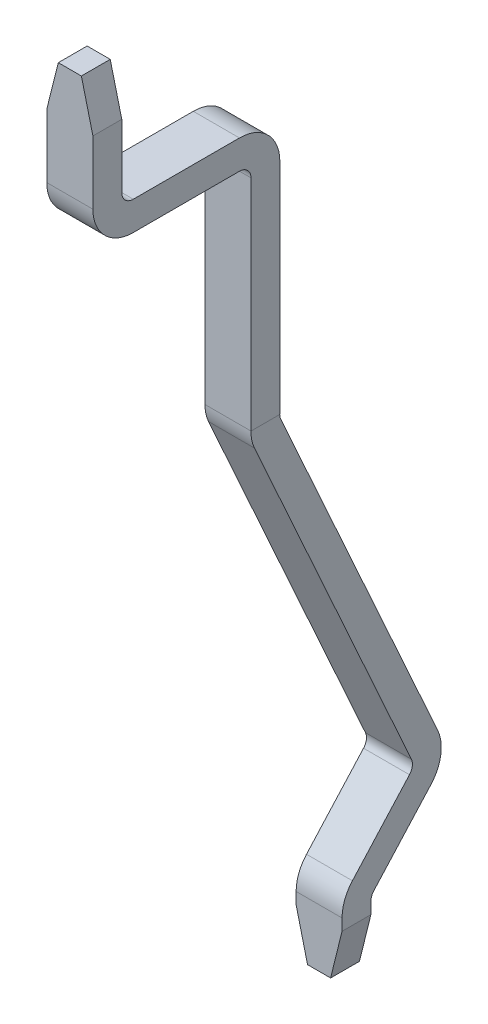
ISO-10303-21;
HEADER;
FILE_DESCRIPTION(('STEP AP214'),'2;1');
FILE_NAME('part.step','',(''),(''),'','','');
FILE_SCHEMA(('AUTOMOTIVE_DESIGN { 1 0 10303 214 1 1 1 1 }'));
ENDSEC;
DATA;
#1=APPLICATION_CONTEXT('core data for automotive mechanical design processes');
#2=APPLICATION_PROTOCOL_DEFINITION('international standard','automotive_design',2000,#1);
#3=PRODUCT_CONTEXT('',#1,'mechanical');
#4=PRODUCT('Part','Part','',(#3));
#5=PRODUCT_RELATED_PRODUCT_CATEGORY('part','',(#4));
#6=PRODUCT_DEFINITION_FORMATION('','',#4);
#7=PRODUCT_DEFINITION_CONTEXT('part definition',#1,'design');
#8=PRODUCT_DEFINITION('design','',#6,#7);
#9=PRODUCT_DEFINITION_SHAPE('','',#8);
#10=(LENGTH_UNIT() NAMED_UNIT(*) SI_UNIT(.MILLI.,.METRE.));
#11=(NAMED_UNIT(*) PLANE_ANGLE_UNIT() SI_UNIT($,.RADIAN.));
#12=(NAMED_UNIT(*) SI_UNIT($,.STERADIAN.) SOLID_ANGLE_UNIT());
#13=UNCERTAINTY_MEASURE_WITH_UNIT(LENGTH_MEASURE(1.E-05),#10,'distance_accuracy_value','');
#14=(GEOMETRIC_REPRESENTATION_CONTEXT(3) GLOBAL_UNCERTAINTY_ASSIGNED_CONTEXT((#13)) GLOBAL_UNIT_ASSIGNED_CONTEXT((#10,
#11,#12)) REPRESENTATION_CONTEXT('',''));
#15=CARTESIAN_POINT('',(0.,0.,0.));
#16=DIRECTION('',(0.,0.,1.));
#17=DIRECTION('',(1.,0.,0.));
#18=AXIS2_PLACEMENT_3D('',#15,#16,#17);
#19=CARTESIAN_POINT('',(-0.8,4.575,1.945));
#20=DIRECTION('',(0.,-1.,0.));
#21=DIRECTION('',(0.,0.,-1.));
#22=AXIS2_PLACEMENT_3D('',#19,#20,#21);
#23=PLANE('',#22);
#24=DIRECTION('',(0.,0.,1.));
#25=VECTOR('',#24,1.);
#26=CARTESIAN_POINT('',(-0.9,4.575,8.99552393868072));
#27=LINE('',#26,#25);
#28=CARTESIAN_POINT('',(-0.9,4.575,1.82));
#29=VERTEX_POINT('',#28);
#30=CARTESIAN_POINT('',(-0.9,4.575,2.07));
#31=VERTEX_POINT('',#30);
#32=EDGE_CURVE('E264',#29,#31,#27,.T.);
#33=ORIENTED_EDGE('',*,*,#32,.T.);
#34=DIRECTION('',(-1.,0.,0.));
#35=VECTOR('',#34,1.);
#36=CARTESIAN_POINT('',(-0.6,4.575,2.07));
#37=LINE('',#36,#35);
#38=CARTESIAN_POINT('',(-0.7,4.575,2.07));
#39=VERTEX_POINT('',#38);
#40=EDGE_CURVE('E235',#31,#39,#37,.F.);
#41=ORIENTED_EDGE('',*,*,#40,.T.);
#42=DIRECTION('',(0.,0.,1.));
#43=VECTOR('',#42,1.);
#44=CARTESIAN_POINT('',(-0.7,4.575,8.99552883706733));
#45=LINE('',#44,#43);
#46=CARTESIAN_POINT('',(-0.7,4.575,1.82));
#47=VERTEX_POINT('',#46);
#48=EDGE_CURVE('E214',#47,#39,#45,.T.);
#49=ORIENTED_EDGE('',*,*,#48,.F.);
#50=DIRECTION('',(1.,0.,0.));
#51=VECTOR('',#50,1.);
#52=CARTESIAN_POINT('',(-1.,4.575,1.82));
#53=LINE('',#52,#51);
#54=EDGE_CURVE('E251',#47,#29,#53,.F.);
#55=ORIENTED_EDGE('',*,*,#54,.T.);
#56=EDGE_LOOP('',(#33,#41,#49,#55));
#57=FACE_BOUND('',#56,.T.);
#58=ADVANCED_FACE('F17',(#57),#23,.F.);
#59=CARTESIAN_POINT('',(-0.9,4.575,8.99552393868072));
#60=DIRECTION('',(0.970142500145331,-0.242535625036336,0.));
#61=DIRECTION('',(0.242535625036336,0.970142500145331,0.));
#62=AXIS2_PLACEMENT_3D('',#59,#60,#61);
#63=PLANE('',#62);
#64=DIRECTION('',(0.242535625036333,0.970142500145332,0.));
#65=VECTOR('',#64,1.);
#66=CARTESIAN_POINT('',(-1.,4.175,2.07));
#67=LINE('',#66,#65);
#68=CARTESIAN_POINT('',(-1.,4.175,2.07));
#69=VERTEX_POINT('',#68);
#70=EDGE_CURVE('E202',#69,#31,#67,.T.);
#71=ORIENTED_EDGE('',*,*,#70,.T.);
#72=ORIENTED_EDGE('',*,*,#32,.F.);
#73=DIRECTION('',(-0.242535625036333,-0.970142500145332,0.));
#74=VECTOR('',#73,1.);
#75=CARTESIAN_POINT('',(-0.9,4.575,1.82));
#76=LINE('',#75,#74);
#77=CARTESIAN_POINT('',(-1.,4.175,1.82));
#78=VERTEX_POINT('',#77);
#79=EDGE_CURVE('E231',#29,#78,#76,.T.);
#80=ORIENTED_EDGE('',*,*,#79,.T.);
#81=DIRECTION('',(0.,0.,1.));
#82=VECTOR('',#81,1.);
#83=CARTESIAN_POINT('',(-1.,4.175,2.07));
#84=LINE('',#83,#82);
#85=EDGE_CURVE('E242',#78,#69,#84,.T.);
#86=ORIENTED_EDGE('',*,*,#85,.T.);
#87=EDGE_LOOP('',(#71,#72,#80,#86));
#88=FACE_BOUND('',#87,.T.);
#89=ADVANCED_FACE('F401',(#88),#63,.F.);
#90=CARTESIAN_POINT('',(-1.,4.575,1.82));
#91=DIRECTION('',(0.,0.,1.));
#92=DIRECTION('',(0.,-1.,0.));
#93=AXIS2_PLACEMENT_3D('',#90,#91,#92);
#94=PLANE('',#93);
#95=ORIENTED_EDGE('',*,*,#79,.F.);
#96=ORIENTED_EDGE('',*,*,#54,.F.);
#97=DIRECTION('',(-0.242535625036336,0.970142500145331,0.));
#98=VECTOR('',#97,1.);
#99=CARTESIAN_POINT('',(-0.7,4.575,1.82));
#100=LINE('',#99,#98);
#101=CARTESIAN_POINT('',(-0.6,4.175,1.82));
#102=VERTEX_POINT('',#101);
#103=EDGE_CURVE('E232',#102,#47,#100,.T.);
#104=ORIENTED_EDGE('',*,*,#103,.F.);
#105=DIRECTION('',(0.,1.,0.));
#106=VECTOR('',#105,1.);
#107=CARTESIAN_POINT('',(-0.6,4.575,1.82));
#108=LINE('',#107,#106);
#109=CARTESIAN_POINT('',(-0.6,3.625,1.82));
#110=VERTEX_POINT('',#109);
#111=EDGE_CURVE('E221',#102,#110,#108,.F.);
#112=ORIENTED_EDGE('',*,*,#111,.T.);
#113=DIRECTION('',(1.,0.,0.));
#114=VECTOR('',#113,1.);
#115=CARTESIAN_POINT('',(-0.8,3.625,1.81999999999999));
#116=LINE('',#115,#114);
#117=CARTESIAN_POINT('',(-1.,3.625,1.82));
#118=VERTEX_POINT('',#117);
#119=EDGE_CURVE('E229',#110,#118,#116,.F.);
#120=ORIENTED_EDGE('',*,*,#119,.T.);
#121=DIRECTION('',(0.,1.,0.));
#122=VECTOR('',#121,1.);
#123=CARTESIAN_POINT('',(-1.,4.575,1.82));
#124=LINE('',#123,#122);
#125=EDGE_CURVE('E246',#118,#78,#124,.T.);
#126=ORIENTED_EDGE('',*,*,#125,.T.);
#127=EDGE_LOOP('',(#95,#96,#104,#112,#120,#126));
#128=FACE_BOUND('',#127,.T.);
#129=ADVANCED_FACE('F396',(#128),#94,.F.);
#130=CARTESIAN_POINT('',(-0.8,3.625,1.72));
#131=DIRECTION('',(1.,0.,0.));
#132=DIRECTION('',(0.,1.,0.));
#133=AXIS2_PLACEMENT_3D('',#130,#131,#132);
#134=CYLINDRICAL_SURFACE('',#133,0.0999999999999946);
#135=ORIENTED_EDGE('',*,*,#119,.F.);
#136=CARTESIAN_POINT('',(-0.6,3.625,1.72));
#137=DIRECTION('',(1.,0.,0.));
#138=DIRECTION('',(0.,1.,0.));
#139=AXIS2_PLACEMENT_3D('',#136,#137,#138);
#140=CIRCLE('',#139,0.0999999999999946);
#141=CARTESIAN_POINT('',(-0.6,3.525,1.72));
#142=VERTEX_POINT('',#141);
#143=EDGE_CURVE('E335',#110,#142,#140,.T.);
#144=ORIENTED_EDGE('',*,*,#143,.T.);
#145=DIRECTION('',(1.,0.,0.));
#146=VECTOR('',#145,1.);
#147=CARTESIAN_POINT('',(-1.,3.525,1.72));
#148=LINE('',#147,#146);
#149=CARTESIAN_POINT('',(-1.,3.525,1.72));
#150=VERTEX_POINT('',#149);
#151=EDGE_CURVE('E227',#142,#150,#148,.F.);
#152=ORIENTED_EDGE('',*,*,#151,.T.);
#153=CARTESIAN_POINT('',(-1.,3.625,1.72));
#154=DIRECTION('',(1.,0.,0.));
#155=DIRECTION('',(0.,1.,0.));
#156=AXIS2_PLACEMENT_3D('',#153,#154,#155);
#157=CIRCLE('',#156,0.0999999999999946);
#158=EDGE_CURVE('E340',#150,#118,#157,.F.);
#159=ORIENTED_EDGE('',*,*,#158,.T.);
#160=EDGE_LOOP('',(#135,#144,#152,#159));
#161=FACE_BOUND('',#160,.T.);
#162=ADVANCED_FACE('F393',(#161),#134,.F.);
#163=CARTESIAN_POINT('',(-1.,3.525,1.72));
#164=DIRECTION('',(0.,-1.,0.));
#165=DIRECTION('',(0.,0.,-1.));
#166=AXIS2_PLACEMENT_3D('',#163,#164,#165);
#167=PLANE('',#166);
#168=ORIENTED_EDGE('',*,*,#151,.F.);
#169=DIRECTION('',(0.,0.,1.));
#170=VECTOR('',#169,1.);
#171=CARTESIAN_POINT('',(-0.6,3.525,1.82));
#172=LINE('',#171,#170);
#173=CARTESIAN_POINT('',(-0.600000000000002,3.525,0.800000000000004));
#174=VERTEX_POINT('',#173);
#175=EDGE_CURVE('E334',#142,#174,#172,.F.);
#176=ORIENTED_EDGE('',*,*,#175,.T.);
#177=DIRECTION('',(-1.,0.,0.));
#178=VECTOR('',#177,1.);
#179=CARTESIAN_POINT('',(-0.8,3.525,0.800000000000004));
#180=LINE('',#179,#178);
#181=CARTESIAN_POINT('',(-1.,3.525,0.800000000000004));
#182=VERTEX_POINT('',#181);
#183=EDGE_CURVE('E178',#182,#174,#180,.F.);
#184=ORIENTED_EDGE('',*,*,#183,.F.);
#185=DIRECTION('',(0.,0.,1.));
#186=VECTOR('',#185,1.);
#187=CARTESIAN_POINT('',(-1.,3.525,2.07));
#188=LINE('',#187,#186);
#189=EDGE_CURVE('E343',#182,#150,#188,.T.);
#190=ORIENTED_EDGE('',*,*,#189,.T.);
#191=EDGE_LOOP('',(#168,#176,#184,#190));
#192=FACE_BOUND('',#191,.T.);
#193=ADVANCED_FACE('F384',(#192),#167,.F.);
#194=CARTESIAN_POINT('',(-0.8,3.175,0.800000000000004));
#195=DIRECTION('',(-1.,0.,0.));
#196=DIRECTION('',(0.,-1.,0.));
#197=AXIS2_PLACEMENT_3D('',#194,#195,#196);
#198=CYLINDRICAL_SURFACE('',#197,0.350000000000005);
#199=CARTESIAN_POINT('',(-0.6,3.175,0.800000000000004));
#200=DIRECTION('',(-1.,0.,0.));
#201=DIRECTION('',(0.,-1.,0.));
#202=AXIS2_PLACEMENT_3D('',#199,#200,#201);
#203=CIRCLE('',#202,0.350000000000005);
#204=CARTESIAN_POINT('',(-0.600000000000002,3.175,0.45));
#205=VERTEX_POINT('',#204);
#206=EDGE_CURVE('E330',#174,#205,#203,.T.);
#207=ORIENTED_EDGE('',*,*,#206,.T.);
#208=DIRECTION('',(1.,0.,0.));
#209=VECTOR('',#208,1.);
#210=CARTESIAN_POINT('',(-1.,3.175,0.45));
#211=LINE('',#210,#209);
#212=CARTESIAN_POINT('',(-1.,3.175,0.45));
#213=VERTEX_POINT('',#212);
#214=EDGE_CURVE('E218',#205,#213,#211,.F.);
#215=ORIENTED_EDGE('',*,*,#214,.T.);
#216=CARTESIAN_POINT('',(-1.,3.175,0.800000000000004));
#217=DIRECTION('',(-1.,0.,0.));
#218=DIRECTION('',(0.,-1.,0.));
#219=AXIS2_PLACEMENT_3D('',#216,#217,#218);
#220=CIRCLE('',#219,0.350000000000005);
#221=EDGE_CURVE('E188',#213,#182,#220,.F.);
#222=ORIENTED_EDGE('',*,*,#221,.T.);
#223=ORIENTED_EDGE('',*,*,#183,.T.);
#224=EDGE_LOOP('',(#207,#215,#222,#223));
#225=FACE_BOUND('',#224,.T.);
#226=ADVANCED_FACE('F389',(#225),#198,.T.);
#227=CARTESIAN_POINT('',(-1.,3.175,0.45));
#228=DIRECTION('',(0.,0.,1.));
#229=DIRECTION('',(0.,-1.,0.));
#230=AXIS2_PLACEMENT_3D('',#227,#228,#229);
#231=PLANE('',#230);
#232=ORIENTED_EDGE('',*,*,#214,.F.);
#233=DIRECTION('',(0.,1.,0.));
#234=VECTOR('',#233,1.);
#235=CARTESIAN_POINT('',(-0.600000000000005,4.575,0.449999999999999));
#236=LINE('',#235,#234);
#237=CARTESIAN_POINT('',(-0.600000000000005,1.275,0.449999999999999));
#238=VERTEX_POINT('',#237);
#239=EDGE_CURVE('E333',#205,#238,#236,.F.);
#240=ORIENTED_EDGE('',*,*,#239,.T.);
#241=DIRECTION('',(1.,0.,0.));
#242=VECTOR('',#241,1.);
#243=CARTESIAN_POINT('',(-0.60100000000001,1.275,0.449999999999998));
#244=LINE('',#243,#242);
#245=CARTESIAN_POINT('',(-0.601000000000005,1.275,0.449999999999999));
#246=VERTEX_POINT('',#245);
#247=EDGE_CURVE('E224',#246,#238,#244,.T.);
#248=ORIENTED_EDGE('',*,*,#247,.F.);
#249=DIRECTION('',(1.,0.,0.));
#250=VECTOR('',#249,1.);
#251=CARTESIAN_POINT('',(-1.,1.275,0.45));
#252=LINE('',#251,#250);
#253=CARTESIAN_POINT('',(-0.998999999999995,1.275,0.449999999999999));
#254=VERTEX_POINT('',#253);
#255=EDGE_CURVE('E174',#254,#246,#252,.T.);
#256=ORIENTED_EDGE('',*,*,#255,.F.);
#257=DIRECTION('',(1.,0.,0.));
#258=VECTOR('',#257,1.);
#259=CARTESIAN_POINT('',(-0.998999999999996,1.275,0.45));
#260=LINE('',#259,#258);
#261=CARTESIAN_POINT('',(-1.,1.275,0.45));
#262=VERTEX_POINT('',#261);
#263=EDGE_CURVE('E20',#262,#254,#260,.T.);
#264=ORIENTED_EDGE('',*,*,#263,.F.);
#265=DIRECTION('',(0.,1.,0.));
#266=VECTOR('',#265,1.);
#267=CARTESIAN_POINT('',(-1.,4.575,0.45));
#268=LINE('',#267,#266);
#269=EDGE_CURVE('E172',#262,#213,#268,.T.);
#270=ORIENTED_EDGE('',*,*,#269,.T.);
#271=EDGE_LOOP('',(#232,#240,#248,#256,#264,#270));
#272=FACE_BOUND('',#271,.T.);
#273=ADVANCED_FACE('F171',(#272),#231,.F.);
#274=CARTESIAN_POINT('',(-0.6,3.275,1.72));
#275=DIRECTION('',(0.,1.,0.));
#276=DIRECTION('',(0.,0.,1.));
#277=AXIS2_PLACEMENT_3D('',#274,#275,#276);
#278=PLANE('',#277);
#279=DIRECTION('',(1.,0.,0.));
#280=VECTOR('',#279,1.);
#281=CARTESIAN_POINT('',(-0.8,3.27500000000001,1.72));
#282=LINE('',#281,#280);
#283=CARTESIAN_POINT('',(-1.,3.275,1.72));
#284=VERTEX_POINT('',#283);
#285=CARTESIAN_POINT('',(-0.6,3.275,1.72));
#286=VERTEX_POINT('',#285);
#287=EDGE_CURVE('E203',#284,#286,#282,.T.);
#288=ORIENTED_EDGE('',*,*,#287,.F.);
#289=DIRECTION('',(0.,0.,1.));
#290=VECTOR('',#289,1.);
#291=CARTESIAN_POINT('',(-1.,3.275,2.07));
#292=LINE('',#291,#290);
#293=CARTESIAN_POINT('',(-1.,3.275,0.800000000000004));
#294=VERTEX_POINT('',#293);
#295=EDGE_CURVE('E194',#284,#294,#292,.F.);
#296=ORIENTED_EDGE('',*,*,#295,.T.);
#297=DIRECTION('',(-1.,0.,0.));
#298=VECTOR('',#297,1.);
#299=CARTESIAN_POINT('',(-0.8,3.275,0.800000000000004));
#300=LINE('',#299,#298);
#301=CARTESIAN_POINT('',(-0.6,3.275,0.800000000000004));
#302=VERTEX_POINT('',#301);
#303=EDGE_CURVE('E219',#294,#302,#300,.F.);
#304=ORIENTED_EDGE('',*,*,#303,.T.);
#305=DIRECTION('',(0.,0.,1.));
#306=VECTOR('',#305,1.);
#307=CARTESIAN_POINT('',(-0.6,3.275,1.82));
#308=LINE('',#307,#306);
#309=EDGE_CURVE('E325',#302,#286,#308,.T.);
#310=ORIENTED_EDGE('',*,*,#309,.T.);
#311=EDGE_LOOP('',(#288,#296,#304,#310));
#312=FACE_BOUND('',#311,.T.);
#313=ADVANCED_FACE('F535',(#312),#278,.F.);
#314=CARTESIAN_POINT('',(-0.8,3.625,1.72));
#315=DIRECTION('',(1.,0.,0.));
#316=DIRECTION('',(0.,1.,0.));
#317=AXIS2_PLACEMENT_3D('',#314,#315,#316);
#318=CYLINDRICAL_SURFACE('',#317,0.349999999999995);
#319=CARTESIAN_POINT('',(-1.,3.625,1.72));
#320=DIRECTION('',(1.,0.,0.));
#321=DIRECTION('',(0.,1.,0.));
#322=AXIS2_PLACEMENT_3D('',#319,#320,#321);
#323=CIRCLE('',#322,0.349999999999995);
#324=CARTESIAN_POINT('',(-1.,3.625,2.07));
#325=VERTEX_POINT('',#324);
#326=EDGE_CURVE('E196',#325,#284,#323,.T.);
#327=ORIENTED_EDGE('',*,*,#326,.T.);
#328=ORIENTED_EDGE('',*,*,#287,.T.);
#329=CARTESIAN_POINT('',(-0.6,3.625,1.72));
#330=DIRECTION('',(1.,0.,0.));
#331=DIRECTION('',(0.,1.,0.));
#332=AXIS2_PLACEMENT_3D('',#329,#330,#331);
#333=CIRCLE('',#332,0.349999999999995);
#334=CARTESIAN_POINT('',(-0.6,3.625,2.07));
#335=VERTEX_POINT('',#334);
#336=EDGE_CURVE('E322',#286,#335,#333,.F.);
#337=ORIENTED_EDGE('',*,*,#336,.T.);
#338=DIRECTION('',(-1.,0.,0.));
#339=VECTOR('',#338,1.);
#340=CARTESIAN_POINT('',(-0.6,3.625,2.07));
#341=LINE('',#340,#339);
#342=EDGE_CURVE('E199',#335,#325,#341,.T.);
#343=ORIENTED_EDGE('',*,*,#342,.T.);
#344=EDGE_LOOP('',(#327,#328,#337,#343));
#345=FACE_BOUND('',#344,.T.);
#346=ADVANCED_FACE('F532',(#345),#318,.T.);
#347=CARTESIAN_POINT('',(-0.6,4.575,2.07));
#348=DIRECTION('',(0.,0.,-1.));
#349=DIRECTION('',(-1.,0.,0.));
#350=AXIS2_PLACEMENT_3D('',#347,#348,#349);
#351=PLANE('',#350);
#352=ORIENTED_EDGE('',*,*,#70,.F.);
#353=DIRECTION('',(0.,1.,0.));
#354=VECTOR('',#353,1.);
#355=CARTESIAN_POINT('',(-1.,4.575,2.07));
#356=LINE('',#355,#354);
#357=EDGE_CURVE('E245',#69,#325,#356,.F.);
#358=ORIENTED_EDGE('',*,*,#357,.T.);
#359=ORIENTED_EDGE('',*,*,#342,.F.);
#360=DIRECTION('',(0.,1.,0.));
#361=VECTOR('',#360,1.);
#362=CARTESIAN_POINT('',(-0.599999999999999,4.575,2.07));
#363=LINE('',#362,#361);
#364=CARTESIAN_POINT('',(-0.599999999999999,4.175,2.07));
#365=VERTEX_POINT('',#364);
#366=EDGE_CURVE('E208',#335,#365,#363,.T.);
#367=ORIENTED_EDGE('',*,*,#366,.T.);
#368=DIRECTION('',(-0.242535625036336,0.970142500145331,0.));
#369=VECTOR('',#368,1.);
#370=CARTESIAN_POINT('',(-0.7,4.575,2.07));
#371=LINE('',#370,#369);
#372=EDGE_CURVE('E211',#39,#365,#371,.F.);
#373=ORIENTED_EDGE('',*,*,#372,.F.);
#374=ORIENTED_EDGE('',*,*,#40,.F.);
#375=EDGE_LOOP('',(#352,#358,#359,#367,#373,#374));
#376=FACE_BOUND('',#375,.T.);
#377=ADVANCED_FACE('F528',(#376),#351,.F.);
#378=CARTESIAN_POINT('',(-0.7,4.575,8.99552883706733));
#379=DIRECTION('',(0.970142500145331,0.242535625036336,0.));
#380=DIRECTION('',(-0.242535625036336,0.970142500145331,0.));
#381=AXIS2_PLACEMENT_3D('',#378,#379,#380);
#382=PLANE('',#381);
#383=ORIENTED_EDGE('',*,*,#372,.T.);
#384=DIRECTION('',(0.,0.,1.));
#385=VECTOR('',#384,1.);
#386=CARTESIAN_POINT('',(-0.6,4.175,1.82));
#387=LINE('',#386,#385);
#388=EDGE_CURVE('E204',#365,#102,#387,.F.);
#389=ORIENTED_EDGE('',*,*,#388,.T.);
#390=ORIENTED_EDGE('',*,*,#103,.T.);
#391=ORIENTED_EDGE('',*,*,#48,.T.);
#392=EDGE_LOOP('',(#383,#389,#390,#391));
#393=FACE_BOUND('',#392,.T.);
#394=ADVANCED_FACE('F525',(#393),#382,.T.);
#395=CARTESIAN_POINT('',(-1.,4.575,2.07));
#396=DIRECTION('',(1.,0.,0.));
#397=DIRECTION('',(0.,1.,0.));
#398=AXIS2_PLACEMENT_3D('',#395,#396,#397);
#399=PLANE('',#398);
#400=ORIENTED_EDGE('',*,*,#85,.F.);
#401=ORIENTED_EDGE('',*,*,#125,.F.);
#402=ORIENTED_EDGE('',*,*,#158,.F.);
#403=ORIENTED_EDGE('',*,*,#189,.F.);
#404=ORIENTED_EDGE('',*,*,#221,.F.);
#405=ORIENTED_EDGE('',*,*,#269,.F.);
#406=DIRECTION('',(0.,0.,1.));
#407=VECTOR('',#406,1.);
#408=CARTESIAN_POINT('',(-1.,1.275,2.07));
#409=LINE('',#408,#407);
#410=CARTESIAN_POINT('',(-0.999999999999998,1.275,0.7));
#411=VERTEX_POINT('',#410);
#412=EDGE_CURVE('E184',#411,#262,#409,.F.);
#413=ORIENTED_EDGE('',*,*,#412,.F.);
#414=DIRECTION('',(0.,1.,0.));
#415=VECTOR('',#414,1.);
#416=CARTESIAN_POINT('',(-0.999999999999996,3.175,0.7));
#417=LINE('',#416,#415);
#418=CARTESIAN_POINT('',(-0.999999999999998,3.175,0.7));
#419=VERTEX_POINT('',#418);
#420=EDGE_CURVE('E207',#411,#419,#417,.T.);
#421=ORIENTED_EDGE('',*,*,#420,.T.);
#422=CARTESIAN_POINT('',(-1.,3.175,0.800000000000004));
#423=DIRECTION('',(-1.,0.,0.));
#424=DIRECTION('',(0.,-1.,0.));
#425=AXIS2_PLACEMENT_3D('',#422,#423,#424);
#426=CIRCLE('',#425,0.100000000000005);
#427=EDGE_CURVE('E222',#419,#294,#426,.F.);
#428=ORIENTED_EDGE('',*,*,#427,.T.);
#429=ORIENTED_EDGE('',*,*,#295,.F.);
#430=ORIENTED_EDGE('',*,*,#326,.F.);
#431=ORIENTED_EDGE('',*,*,#357,.F.);
#432=EDGE_LOOP('',(#400,#401,#402,#403,#404,#405,#413,#421,#428,#429,#430,#431));
#433=FACE_BOUND('',#432,.T.);
#434=ADVANCED_FACE('F182',(#433),#399,.F.);
#435=CARTESIAN_POINT('',(-0.8,3.175,0.800000000000004));
#436=DIRECTION('',(-1.,0.,0.));
#437=DIRECTION('',(0.,-1.,0.));
#438=AXIS2_PLACEMENT_3D('',#435,#436,#437);
#439=CYLINDRICAL_SURFACE('',#438,0.100000000000005);
#440=ORIENTED_EDGE('',*,*,#303,.F.);
#441=ORIENTED_EDGE('',*,*,#427,.F.);
#442=DIRECTION('',(-1.,0.,0.));
#443=VECTOR('',#442,1.);
#444=CARTESIAN_POINT('',(-0.6,3.175,0.7));
#445=LINE('',#444,#443);
#446=CARTESIAN_POINT('',(-0.6,3.175,0.7));
#447=VERTEX_POINT('',#446);
#448=EDGE_CURVE('E371',#419,#447,#445,.F.);
#449=ORIENTED_EDGE('',*,*,#448,.T.);
#450=CARTESIAN_POINT('',(-0.6,3.175,0.800000000000004));
#451=DIRECTION('',(-1.,0.,0.));
#452=DIRECTION('',(0.,-1.,0.));
#453=AXIS2_PLACEMENT_3D('',#450,#451,#452);
#454=CIRCLE('',#453,0.100000000000005);
#455=EDGE_CURVE('E326',#447,#302,#454,.F.);
#456=ORIENTED_EDGE('',*,*,#455,.T.);
#457=EDGE_LOOP('',(#440,#441,#449,#456));
#458=FACE_BOUND('',#457,.T.);
#459=ADVANCED_FACE('F519',(#458),#439,.F.);
#460=CARTESIAN_POINT('',(-0.6,4.575,1.82));
#461=DIRECTION('',(-1.,0.,0.));
#462=DIRECTION('',(0.,0.,1.));
#463=AXIS2_PLACEMENT_3D('',#460,#461,#462);
#464=PLANE('',#463);
#465=ORIENTED_EDGE('',*,*,#366,.F.);
#466=ORIENTED_EDGE('',*,*,#336,.F.);
#467=ORIENTED_EDGE('',*,*,#309,.F.);
#468=ORIENTED_EDGE('',*,*,#455,.F.);
#469=DIRECTION('',(0.,1.,0.));
#470=VECTOR('',#469,1.);
#471=CARTESIAN_POINT('',(-0.6,3.175,0.7));
#472=LINE('',#471,#470);
#473=CARTESIAN_POINT('',(-0.600000000000002,1.275,0.7));
#474=VERTEX_POINT('',#473);
#475=EDGE_CURVE('E359',#447,#474,#472,.F.);
#476=ORIENTED_EDGE('',*,*,#475,.T.);
#477=DIRECTION('',(0.,0.,1.));
#478=VECTOR('',#477,1.);
#479=CARTESIAN_POINT('',(-0.6,1.275,1.82));
#480=LINE('',#479,#478);
#481=EDGE_CURVE('E329',#238,#474,#480,.T.);
#482=ORIENTED_EDGE('',*,*,#481,.F.);
#483=ORIENTED_EDGE('',*,*,#239,.F.);
#484=ORIENTED_EDGE('',*,*,#206,.F.);
#485=ORIENTED_EDGE('',*,*,#175,.F.);
#486=ORIENTED_EDGE('',*,*,#143,.F.);
#487=ORIENTED_EDGE('',*,*,#111,.F.);
#488=ORIENTED_EDGE('',*,*,#388,.F.);
#489=EDGE_LOOP('',(#465,#466,#467,#468,#476,#482,#483,#484,#485,#486,#487,#488));
#490=FACE_BOUND('',#489,.T.);
#491=ADVANCED_FACE('F356',(#490),#464,.F.);
#492=CARTESIAN_POINT('',(-0.6,3.175,0.7));
#493=DIRECTION('',(0.,0.,-1.));
#494=DIRECTION('',(-1.,0.,0.));
#495=AXIS2_PLACEMENT_3D('',#492,#493,#494);
#496=PLANE('',#495);
#497=ORIENTED_EDGE('',*,*,#448,.F.);
#498=ORIENTED_EDGE('',*,*,#420,.F.);
#499=DIRECTION('',(-1.,0.,0.));
#500=VECTOR('',#499,1.);
#501=CARTESIAN_POINT('',(-0.6,1.275,0.7));
#502=LINE('',#501,#500);
#503=CARTESIAN_POINT('',(-0.998999999999993,1.275,0.699999999999999));
#504=VERTEX_POINT('',#503);
#505=EDGE_CURVE('E193',#411,#504,#502,.F.);
#506=ORIENTED_EDGE('',*,*,#505,.T.);
#507=DIRECTION('',(1.,0.,0.));
#508=VECTOR('',#507,1.);
#509=CARTESIAN_POINT('',(-0.8,1.275,0.699999999999998));
#510=LINE('',#509,#508);
#511=CARTESIAN_POINT('',(-0.601000000000003,1.275,0.699999999999999));
#512=VERTEX_POINT('',#511);
#513=EDGE_CURVE('E316',#512,#504,#510,.F.);
#514=ORIENTED_EDGE('',*,*,#513,.F.);
#515=DIRECTION('',(-1.,0.,0.));
#516=VECTOR('',#515,1.);
#517=CARTESIAN_POINT('',(-0.6,1.275,0.7));
#518=LINE('',#517,#516);
#519=EDGE_CURVE('E317',#512,#474,#518,.F.);
#520=ORIENTED_EDGE('',*,*,#519,.T.);
#521=ORIENTED_EDGE('',*,*,#475,.F.);
#522=EDGE_LOOP('',(#497,#498,#506,#514,#520,#521));
#523=FACE_BOUND('',#522,.T.);
#524=ADVANCED_FACE('F512',(#523),#496,.F.);
#525=CARTESIAN_POINT('',(-0.800000000000001,-3.275,-0.215));
#526=DIRECTION('',(0.,-1.,0.));
#527=DIRECTION('',(0.,0.,-1.));
#528=AXIS2_PLACEMENT_3D('',#525,#526,#527);
#529=PLANE('',#528);
#530=DIRECTION('',(1.,0.,0.));
#531=VECTOR('',#530,1.);
#532=CARTESIAN_POINT('',(-0.6,-3.275,-0.0900000000000004));
#533=LINE('',#532,#531);
#534=CARTESIAN_POINT('',(-0.7,-3.275,-0.0900000000000002));
#535=VERTEX_POINT('',#534);
#536=CARTESIAN_POINT('',(-0.9,-3.275,-0.0900000000000002));
#537=VERTEX_POINT('',#536);
#538=EDGE_CURVE('E638',#535,#537,#533,.F.);
#539=ORIENTED_EDGE('',*,*,#538,.T.);
#540=DIRECTION('',(0.,0.,1.));
#541=VECTOR('',#540,1.);
#542=CARTESIAN_POINT('',(-0.9,-3.275,-7.84552393868072));
#543=LINE('',#542,#541);
#544=CARTESIAN_POINT('',(-0.9,-3.275,-0.34));
#545=VERTEX_POINT('',#544);
#546=EDGE_CURVE('E320',#537,#545,#543,.F.);
#547=ORIENTED_EDGE('',*,*,#546,.T.);
#548=DIRECTION('',(1.,0.,0.));
#549=VECTOR('',#548,1.);
#550=CARTESIAN_POINT('',(-1.,-3.275,-0.34));
#551=LINE('',#550,#549);
#552=CARTESIAN_POINT('',(-0.7,-3.275,-0.34));
#553=VERTEX_POINT('',#552);
#554=EDGE_CURVE('E595',#545,#553,#551,.T.);
#555=ORIENTED_EDGE('',*,*,#554,.T.);
#556=DIRECTION('',(0.,0.,1.));
#557=VECTOR('',#556,1.);
#558=CARTESIAN_POINT('',(-0.7,-3.275,-7.84552393868072));
#559=LINE('',#558,#557);
#560=EDGE_CURVE('E321',#535,#553,#559,.F.);
#561=ORIENTED_EDGE('',*,*,#560,.F.);
#562=EDGE_LOOP('',(#539,#547,#555,#561));
#563=FACE_BOUND('',#562,.T.);
#564=ADVANCED_FACE('F508',(#563),#529,.T.);
#565=CARTESIAN_POINT('',(-0.7,-3.275,-7.84552393868072));
#566=DIRECTION('',(0.970710817842158,-0.240250927415917,0.));
#567=DIRECTION('',(0.240250927415917,0.970710817842158,0.));
#568=AXIS2_PLACEMENT_3D('',#565,#566,#567);
#569=PLANE('',#568);
#570=DIRECTION('',(-0.240250927415917,-0.970710817842158,0.));
#571=VECTOR('',#570,1.);
#572=CARTESIAN_POINT('',(-0.601000000000007,-2.875,-0.0900000000000001));
#573=LINE('',#572,#571);
#574=CARTESIAN_POINT('',(-0.601000000000007,-2.875,-0.0900000000000001));
#575=VERTEX_POINT('',#574);
#576=EDGE_CURVE('E634',#575,#535,#573,.T.);
#577=ORIENTED_EDGE('',*,*,#576,.T.);
#578=ORIENTED_EDGE('',*,*,#560,.T.);
#579=DIRECTION('',(0.240250927415917,0.970710817842158,0.));
#580=VECTOR('',#579,1.);
#581=CARTESIAN_POINT('',(-0.7,-3.275,-0.34));
#582=LINE('',#581,#580);
#583=CARTESIAN_POINT('',(-0.601000000000007,-2.875,-0.34));
#584=VERTEX_POINT('',#583);
#585=EDGE_CURVE('E591',#553,#584,#582,.T.);
#586=ORIENTED_EDGE('',*,*,#585,.T.);
#587=DIRECTION('',(0.,0.,-1.));
#588=VECTOR('',#587,1.);
#589=CARTESIAN_POINT('',(-0.601000000000004,-2.875,0.7));
#590=LINE('',#589,#588);
#591=EDGE_CURVE('E581',#575,#584,#590,.T.);
#592=ORIENTED_EDGE('',*,*,#591,.F.);
#593=EDGE_LOOP('',(#577,#578,#586,#592));
#594=FACE_BOUND('',#593,.T.);
#595=ADVANCED_FACE('F505',(#594),#569,.T.);
#596=CARTESIAN_POINT('',(-0.60100000000001,1.275,-0.95));
#597=DIRECTION('',(0.,1.,0.));
#598=DIRECTION('',(0.,0.,1.));
#599=AXIS2_PLACEMENT_3D('',#596,#597,#598);
#600=PLANE('',#599);
#601=ORIENTED_EDGE('',*,*,#519,.F.);
#602=DIRECTION('',(0.,0.,-1.));
#603=VECTOR('',#602,1.);
#604=CARTESIAN_POINT('',(-0.601000000000004,1.275,0.7));
#605=LINE('',#604,#603);
#606=EDGE_CURVE('E306',#246,#512,#605,.F.);
#607=ORIENTED_EDGE('',*,*,#606,.F.);
#608=ORIENTED_EDGE('',*,*,#247,.T.);
#609=ORIENTED_EDGE('',*,*,#481,.T.);
#610=EDGE_LOOP('',(#601,#607,#608,#609));
#611=FACE_BOUND('',#610,.T.);
#612=ADVANCED_FACE('F349',(#611),#600,.F.);
#613=CARTESIAN_POINT('',(-0.9,-3.275,-7.84552393868072));
#614=DIRECTION('',(0.970710817842158,0.240250927415917,0.));
#615=DIRECTION('',(-0.240250927415917,0.970710817842158,0.));
#616=AXIS2_PLACEMENT_3D('',#613,#614,#615);
#617=PLANE('',#616);
#618=DIRECTION('',(-0.240250927415917,0.970710817842158,0.));
#619=VECTOR('',#618,1.);
#620=CARTESIAN_POINT('',(-0.9,-3.275,-0.0900000000000004));
#621=LINE('',#620,#619);
#622=CARTESIAN_POINT('',(-0.998999999999993,-2.875,-0.0900000000000001));
#623=VERTEX_POINT('',#622);
#624=EDGE_CURVE('E635',#537,#623,#621,.T.);
#625=ORIENTED_EDGE('',*,*,#624,.T.);
#626=DIRECTION('',(0.,0.,1.));
#627=VECTOR('',#626,1.);
#628=CARTESIAN_POINT('',(-0.998999999999996,-2.875,0.7));
#629=LINE('',#628,#627);
#630=CARTESIAN_POINT('',(-0.998999999999993,-2.875,-0.34));
#631=VERTEX_POINT('',#630);
#632=EDGE_CURVE('E294',#631,#623,#629,.T.);
#633=ORIENTED_EDGE('',*,*,#632,.F.);
#634=DIRECTION('',(0.240250927415917,-0.970710817842158,0.));
#635=VECTOR('',#634,1.);
#636=CARTESIAN_POINT('',(-0.998999999999993,-2.875,-0.34));
#637=LINE('',#636,#635);
#638=EDGE_CURVE('E609',#631,#545,#637,.T.);
#639=ORIENTED_EDGE('',*,*,#638,.T.);
#640=ORIENTED_EDGE('',*,*,#546,.F.);
#641=EDGE_LOOP('',(#625,#633,#639,#640));
#642=FACE_BOUND('',#641,.T.);
#643=ADVANCED_FACE('F498',(#642),#617,.F.);
#644=CARTESIAN_POINT('',(-0.6,-2.775,-0.0900000000000001));
#645=DIRECTION('',(0.,0.,-1.));
#646=DIRECTION('',(0.,1.,0.));
#647=AXIS2_PLACEMENT_3D('',#644,#645,#646);
#648=PLANE('',#647);
#649=DIRECTION('',(0.,1.,0.));
#650=VECTOR('',#649,1.);
#651=CARTESIAN_POINT('',(-0.601000000000007,-3.275,-0.0900000000000001));
#652=LINE('',#651,#650);
#653=CARTESIAN_POINT('',(-0.601000000000007,-2.775,-0.0900000000000025));
#654=VERTEX_POINT('',#653);
#655=EDGE_CURVE('E587',#654,#575,#652,.F.);
#656=ORIENTED_EDGE('',*,*,#655,.F.);
#657=DIRECTION('',(1.,0.,0.));
#658=VECTOR('',#657,1.);
#659=CARTESIAN_POINT('',(-0.8,-2.775,-0.090000000000005));
#660=LINE('',#659,#658);
#661=CARTESIAN_POINT('',(-0.998999999999993,-2.775,-0.0900000000000025));
#662=VERTEX_POINT('',#661);
#663=EDGE_CURVE('E632',#662,#654,#660,.T.);
#664=ORIENTED_EDGE('',*,*,#663,.F.);
#665=DIRECTION('',(0.,1.,0.));
#666=VECTOR('',#665,1.);
#667=CARTESIAN_POINT('',(-0.998999999999993,-3.275,-0.0900000000000001));
#668=LINE('',#667,#666);
#669=EDGE_CURVE('E290',#623,#662,#668,.T.);
#670=ORIENTED_EDGE('',*,*,#669,.F.);
#671=ORIENTED_EDGE('',*,*,#624,.F.);
#672=ORIENTED_EDGE('',*,*,#538,.F.);
#673=ORIENTED_EDGE('',*,*,#576,.F.);
#674=EDGE_LOOP('',(#656,#664,#670,#671,#672,#673));
#675=FACE_BOUND('',#674,.T.);
#676=ADVANCED_FACE('F494',(#675),#648,.F.);
#677=CARTESIAN_POINT('',(-0.8,-2.775,-0.44));
#678=DIRECTION('',(1.,0.,0.));
#679=DIRECTION('',(0.,1.,0.));
#680=AXIS2_PLACEMENT_3D('',#677,#678,#679);
#681=CYLINDRICAL_SURFACE('',#680,0.349999999999995);
#682=CARTESIAN_POINT('',(-0.601000000000007,-2.775,-0.44));
#683=DIRECTION('',(1.,0.,0.));
#684=DIRECTION('',(0.,1.,0.));
#685=AXIS2_PLACEMENT_3D('',#682,#683,#684);
#686=CIRCLE('',#685,0.349999999999995);
#687=CARTESIAN_POINT('',(-0.601000000000007,-2.54075423726739,-0.179944385482999));
#688=VERTEX_POINT('',#687);
#689=EDGE_CURVE('E295',#688,#654,#686,.T.);
#690=ORIENTED_EDGE('',*,*,#689,.F.);
#691=DIRECTION('',(1.,0.,0.));
#692=VECTOR('',#691,1.);
#693=CARTESIAN_POINT('',(-0.6,-2.54075423726739,-0.179944385483));
#694=LINE('',#693,#692);
#695=CARTESIAN_POINT('',(-0.998999999999993,-2.54075423726739,-0.179944385482999));
#696=VERTEX_POINT('',#695);
#697=EDGE_CURVE('E629',#688,#696,#694,.F.);
#698=ORIENTED_EDGE('',*,*,#697,.T.);
#699=CARTESIAN_POINT('',(-0.998999999999993,-2.775,-0.44));
#700=DIRECTION('',(1.,0.,0.));
#701=DIRECTION('',(0.,1.,0.));
#702=AXIS2_PLACEMENT_3D('',#699,#700,#701);
#703=CIRCLE('',#702,0.349999999999995);
#704=EDGE_CURVE('E288',#662,#696,#703,.F.);
#705=ORIENTED_EDGE('',*,*,#704,.F.);
#706=ORIENTED_EDGE('',*,*,#663,.T.);
#707=EDGE_LOOP('',(#690,#698,#705,#706));
#708=FACE_BOUND('',#707,.T.);
#709=ADVANCED_FACE('F490',(#708),#681,.T.);
#710=CARTESIAN_POINT('',(-0.6,-1.99192736078075,-0.67430160414772));
#711=DIRECTION('',(0.,-0.669273607807463,-0.743016041477155));
#712=DIRECTION('',(0.,0.743016041477155,-0.669273607807463));
#713=AXIS2_PLACEMENT_3D('',#710,#711,#712);
#714=PLANE('',#713);
#715=ORIENTED_EDGE('',*,*,#697,.F.);
#716=DIRECTION('',(0.,-0.743016041477151,0.669273607807469));
#717=VECTOR('',#716,1.);
#718=CARTESIAN_POINT('',(-0.601000000000009,-1.99192736078075,-0.67430160414772));
#719=LINE('',#718,#717);
#720=CARTESIAN_POINT('',(-0.601000000000009,-1.99192736078075,-0.67430160414772));
#721=VERTEX_POINT('',#720);
#722=EDGE_CURVE('E298',#721,#688,#719,.T.);
#723=ORIENTED_EDGE('',*,*,#722,.F.);
#724=DIRECTION('',(-1.,0.,0.));
#725=VECTOR('',#724,1.);
#726=CARTESIAN_POINT('',(-0.8,-1.99192736078075,-0.67430160414772));
#727=LINE('',#726,#725);
#728=CARTESIAN_POINT('',(-0.998999999999991,-1.99192736078075,-0.674301604147719));
#729=VERTEX_POINT('',#728);
#730=EDGE_CURVE('E626',#721,#729,#727,.T.);
#731=ORIENTED_EDGE('',*,*,#730,.T.);
#732=DIRECTION('',(0.,0.743016041477151,-0.669273607807469));
#733=VECTOR('',#732,1.);
#734=CARTESIAN_POINT('',(-0.998999999999993,-2.54075423726739,-0.179944385482996));
#735=LINE('',#734,#733);
#736=EDGE_CURVE('E287',#696,#729,#735,.T.);
#737=ORIENTED_EDGE('',*,*,#736,.F.);
#738=EDGE_LOOP('',(#715,#723,#731,#737));
#739=FACE_BOUND('',#738,.T.);
#740=ADVANCED_FACE('F486',(#739),#714,.F.);
#741=CARTESIAN_POINT('',(-0.8,-1.925,-0.6));
#742=DIRECTION('',(-1.,0.,0.));
#743=DIRECTION('',(0.,-1.,0.));
#744=AXIS2_PLACEMENT_3D('',#741,#742,#743);
#745=CYLINDRICAL_SURFACE('',#744,0.100000000000005);
#746=ORIENTED_EDGE('',*,*,#730,.F.);
#747=CARTESIAN_POINT('',(-0.60100000000001,-1.925,-0.6));
#748=DIRECTION('',(-1.,0.,0.));
#749=DIRECTION('',(0.,-1.,0.));
#750=AXIS2_PLACEMENT_3D('',#747,#748,#749);
#751=CIRCLE('',#750,0.100000000000005);
#752=CARTESIAN_POINT('',(-0.60100000000001,-1.88387647540836,-0.69115292494024));
#753=VERTEX_POINT('',#752);
#754=EDGE_CURVE('E299',#753,#721,#751,.T.);
#755=ORIENTED_EDGE('',*,*,#754,.F.);
#756=DIRECTION('',(1.,0.,0.));
#757=VECTOR('',#756,1.);
#758=CARTESIAN_POINT('',(-0.6,-1.88387647540836,-0.691152924940239));
#759=LINE('',#758,#757);
#760=CARTESIAN_POINT('',(-0.998999999999991,-1.88387647540836,-0.691152924940241));
#761=VERTEX_POINT('',#760);
#762=EDGE_CURVE('E623',#753,#761,#759,.F.);
#763=ORIENTED_EDGE('',*,*,#762,.T.);
#764=CARTESIAN_POINT('',(-0.998999999999991,-1.925,-0.6));
#765=DIRECTION('',(-1.,0.,0.));
#766=DIRECTION('',(0.,-1.,0.));
#767=AXIS2_PLACEMENT_3D('',#764,#765,#766);
#768=CIRCLE('',#767,0.100000000000005);
#769=EDGE_CURVE('E285',#729,#761,#768,.F.);
#770=ORIENTED_EDGE('',*,*,#769,.F.);
#771=EDGE_LOOP('',(#746,#755,#763,#770));
#772=FACE_BOUND('',#771,.T.);
#773=ADVANCED_FACE('F482',(#772),#745,.F.);
#774=CARTESIAN_POINT('',(-0.6,1.13106766392928,0.669035237290843));
#775=DIRECTION('',(0.,0.411235245916341,-0.911529249402413));
#776=DIRECTION('',(0.,0.911529249402413,0.411235245916341));
#777=AXIS2_PLACEMENT_3D('',#774,#775,#776);
#778=PLANE('',#777);
#779=ORIENTED_EDGE('',*,*,#762,.F.);
#780=DIRECTION('',(0.,-0.911529249402413,-0.411235245916341));
#781=VECTOR('',#780,1.);
#782=CARTESIAN_POINT('',(-0.601000000000004,1.13106766392928,0.669035237290843));
#783=LINE('',#782,#781);
#784=CARTESIAN_POINT('',(-0.601000000000004,1.13106766392928,0.669035237290843));
#785=VERTEX_POINT('',#784);
#786=EDGE_CURVE('E302',#785,#753,#783,.T.);
#787=ORIENTED_EDGE('',*,*,#786,.F.);
#788=DIRECTION('',(1.,0.,0.));
#789=VECTOR('',#788,1.);
#790=CARTESIAN_POINT('',(-0.8,1.13106766392928,0.669035237290842));
#791=LINE('',#790,#789);
#792=CARTESIAN_POINT('',(-0.998999999999993,1.13106766392928,0.669035237290843));
#793=VERTEX_POINT('',#792);
#794=EDGE_CURVE('E621',#793,#785,#791,.T.);
#795=ORIENTED_EDGE('',*,*,#794,.F.);
#796=DIRECTION('',(0.,0.911529249402413,0.411235245916341));
#797=VECTOR('',#796,1.);
#798=CARTESIAN_POINT('',(-0.998999999999991,-1.88387647540836,-0.69115292494024));
#799=LINE('',#798,#797);
#800=EDGE_CURVE('E284',#761,#793,#799,.T.);
#801=ORIENTED_EDGE('',*,*,#800,.F.);
#802=EDGE_LOOP('',(#779,#787,#795,#801));
#803=FACE_BOUND('',#802,.T.);
#804=ADVANCED_FACE('F478',(#803),#778,.F.);
#805=CARTESIAN_POINT('',(-0.8,1.275,0.350000000000003));
#806=DIRECTION('',(1.,0.,0.));
#807=DIRECTION('',(0.,1.,0.));
#808=AXIS2_PLACEMENT_3D('',#805,#806,#807);
#809=CYLINDRICAL_SURFACE('',#808,0.349999999999995);
#810=CARTESIAN_POINT('',(-0.601000000000004,1.275,0.350000000000003));
#811=DIRECTION('',(1.,0.,0.));
#812=DIRECTION('',(0.,1.,0.));
#813=AXIS2_PLACEMENT_3D('',#810,#811,#812);
#814=CIRCLE('',#813,0.349999999999995);
#815=EDGE_CURVE('E303',#512,#785,#814,.T.);
#816=ORIENTED_EDGE('',*,*,#815,.F.);
#817=ORIENTED_EDGE('',*,*,#513,.T.);
#818=CARTESIAN_POINT('',(-0.99899999999999,1.275,0.350000000000003));
#819=DIRECTION('',(1.,0.,0.));
#820=DIRECTION('',(0.,1.,0.));
#821=AXIS2_PLACEMENT_3D('',#818,#819,#820);
#822=CIRCLE('',#821,0.349999999999995);
#823=EDGE_CURVE('E281',#793,#504,#822,.F.);
#824=ORIENTED_EDGE('',*,*,#823,.F.);
#825=ORIENTED_EDGE('',*,*,#794,.T.);
#826=EDGE_LOOP('',(#816,#817,#824,#825));
#827=FACE_BOUND('',#826,.T.);
#828=ADVANCED_FACE('F475',(#827),#809,.T.);
#829=CARTESIAN_POINT('',(-0.998999999999996,1.275,0.7));
#830=DIRECTION('',(0.,1.,0.));
#831=DIRECTION('',(0.,0.,1.));
#832=AXIS2_PLACEMENT_3D('',#829,#830,#831);
#833=PLANE('',#832);
#834=ORIENTED_EDGE('',*,*,#505,.F.);
#835=ORIENTED_EDGE('',*,*,#412,.T.);
#836=ORIENTED_EDGE('',*,*,#263,.T.);
#837=DIRECTION('',(0.,0.,1.));
#838=VECTOR('',#837,1.);
#839=CARTESIAN_POINT('',(-0.998999999999996,1.275,0.7));
#840=LINE('',#839,#838);
#841=EDGE_CURVE('E280',#504,#254,#840,.F.);
#842=ORIENTED_EDGE('',*,*,#841,.F.);
#843=EDGE_LOOP('',(#834,#835,#836,#842));
#844=FACE_BOUND('',#843,.T.);
#845=ADVANCED_FACE('F191',(#844),#833,.F.);
#846=CARTESIAN_POINT('',(-1.,-2.15924576273261,-0.860055614517));
#847=DIRECTION('',(0.,0.669273607807463,0.743016041477155));
#848=DIRECTION('',(0.,-0.743016041477155,0.669273607807463));
#849=AXIS2_PLACEMENT_3D('',#846,#847,#848);
#850=PLANE('',#849);
#851=DIRECTION('',(-1.,0.,0.));
#852=VECTOR('',#851,1.);
#853=CARTESIAN_POINT('',(-0.8,-2.15924576273262,-0.860055614517007));
#854=LINE('',#853,#852);
#855=CARTESIAN_POINT('',(-0.60100000000001,-2.15924576273261,-0.860055614517005));
#856=VERTEX_POINT('',#855);
#857=CARTESIAN_POINT('',(-0.99899999999999,-2.15924576273261,-0.860055614517005));
#858=VERTEX_POINT('',#857);
#859=EDGE_CURVE('E437',#856,#858,#854,.T.);
#860=ORIENTED_EDGE('',*,*,#859,.F.);
#861=DIRECTION('',(0.,0.743016041477162,-0.669273607807455));
#862=VECTOR('',#861,1.);
#863=CARTESIAN_POINT('',(-0.601000000000008,-2.70807263921926,-0.365698395852285));
#864=LINE('',#863,#862);
#865=CARTESIAN_POINT('',(-0.601000000000008,-2.70807263921926,-0.365698395852286));
#866=VERTEX_POINT('',#865);
#867=EDGE_CURVE('E309',#866,#856,#864,.T.);
#868=ORIENTED_EDGE('',*,*,#867,.F.);
#869=DIRECTION('',(1.,0.,0.));
#870=VECTOR('',#869,1.);
#871=CARTESIAN_POINT('',(-0.8,-2.70807263921926,-0.365698395852285));
#872=LINE('',#871,#870);
#873=CARTESIAN_POINT('',(-0.998999999999992,-2.70807263921926,-0.365698395852286));
#874=VERTEX_POINT('',#873);
#875=EDGE_CURVE('E315',#866,#874,#872,.F.);
#876=ORIENTED_EDGE('',*,*,#875,.T.);
#877=DIRECTION('',(0.,-0.743016041477162,0.669273607807455));
#878=VECTOR('',#877,1.);
#879=CARTESIAN_POINT('',(-0.998999999999991,-2.15924576273261,-0.860055614517));
#880=LINE('',#879,#878);
#881=EDGE_CURVE('E275',#858,#874,#880,.T.);
#882=ORIENTED_EDGE('',*,*,#881,.F.);
#883=EDGE_LOOP('',(#860,#868,#876,#882));
#884=FACE_BOUND('',#883,.T.);
#885=ADVANCED_FACE('F468',(#884),#850,.F.);
#886=CARTESIAN_POINT('',(-0.8,-2.775,-0.44));
#887=DIRECTION('',(1.,0.,0.));
#888=DIRECTION('',(0.,1.,0.));
#889=AXIS2_PLACEMENT_3D('',#886,#887,#888);
#890=CYLINDRICAL_SURFACE('',#889,0.0999999999999952);
#891=ORIENTED_EDGE('',*,*,#875,.F.);
#892=CARTESIAN_POINT('',(-0.601000000000008,-2.775,-0.44));
#893=DIRECTION('',(1.,0.,0.));
#894=DIRECTION('',(0.,1.,0.));
#895=AXIS2_PLACEMENT_3D('',#892,#893,#894);
#896=CIRCLE('',#895,0.0999999999999952);
#897=CARTESIAN_POINT('',(-0.601000000000008,-2.775,-0.34));
#898=VERTEX_POINT('',#897);
#899=EDGE_CURVE('E310',#898,#866,#896,.F.);
#900=ORIENTED_EDGE('',*,*,#899,.F.);
#901=DIRECTION('',(1.,0.,0.));
#902=VECTOR('',#901,1.);
#903=CARTESIAN_POINT('',(-1.,-2.775,-0.34));
#904=LINE('',#903,#902);
#905=CARTESIAN_POINT('',(-0.998999999999992,-2.775,-0.34));
#906=VERTEX_POINT('',#905);
#907=EDGE_CURVE('E598',#898,#906,#904,.F.);
#908=ORIENTED_EDGE('',*,*,#907,.T.);
#909=CARTESIAN_POINT('',(-0.998999999999992,-2.775,-0.44));
#910=DIRECTION('',(1.,0.,0.));
#911=DIRECTION('',(0.,1.,0.));
#912=AXIS2_PLACEMENT_3D('',#909,#910,#911);
#913=CIRCLE('',#912,0.0999999999999952);
#914=EDGE_CURVE('E271',#874,#906,#913,.T.);
#915=ORIENTED_EDGE('',*,*,#914,.F.);
#916=EDGE_LOOP('',(#891,#900,#908,#915));
#917=FACE_BOUND('',#916,.T.);
#918=ADVANCED_FACE('F464',(#917),#890,.F.);
#919=CARTESIAN_POINT('',(-1.,-2.775,-0.34));
#920=DIRECTION('',(0.,0.,1.));
#921=DIRECTION('',(0.,-1.,0.));
#922=AXIS2_PLACEMENT_3D('',#919,#920,#921);
#923=PLANE('',#922);
#924=ORIENTED_EDGE('',*,*,#554,.F.);
#925=ORIENTED_EDGE('',*,*,#638,.F.);
#926=DIRECTION('',(0.,1.,0.));
#927=VECTOR('',#926,1.);
#928=CARTESIAN_POINT('',(-0.998999999999993,-3.275,-0.34));
#929=LINE('',#928,#927);
#930=EDGE_CURVE('E274',#906,#631,#929,.F.);
#931=ORIENTED_EDGE('',*,*,#930,.F.);
#932=ORIENTED_EDGE('',*,*,#907,.F.);
#933=DIRECTION('',(0.,1.,0.));
#934=VECTOR('',#933,1.);
#935=CARTESIAN_POINT('',(-0.601000000000008,-3.275,-0.34));
#936=LINE('',#935,#934);
#937=EDGE_CURVE('E313',#584,#898,#936,.T.);
#938=ORIENTED_EDGE('',*,*,#937,.F.);
#939=ORIENTED_EDGE('',*,*,#585,.F.);
#940=EDGE_LOOP('',(#924,#925,#931,#932,#938,#939));
#941=FACE_BOUND('',#940,.T.);
#942=ADVANCED_FACE('F461',(#941),#923,.F.);
#943=CARTESIAN_POINT('',(-0.8,-1.925,-0.6));
#944=DIRECTION('',(-1.,0.,0.));
#945=DIRECTION('',(0.,-1.,0.));
#946=AXIS2_PLACEMENT_3D('',#943,#944,#945);
#947=CYLINDRICAL_SURFACE('',#946,0.350000000000005);
#948=DIRECTION('',(1.,0.,0.));
#949=VECTOR('',#948,1.);
#950=CARTESIAN_POINT('',(-1.,-1.78106766392928,-0.919035237290846));
#951=LINE('',#950,#949);
#952=CARTESIAN_POINT('',(-0.998999999999993,-1.78106766392928,-0.919035237290846));
#953=VERTEX_POINT('',#952);
#954=CARTESIAN_POINT('',(-0.60100000000001,-1.78106766392928,-0.919035237290846));
#955=VERTEX_POINT('',#954);
#956=EDGE_CURVE('E424',#953,#955,#951,.T.);
#957=ORIENTED_EDGE('',*,*,#956,.T.);
#958=CARTESIAN_POINT('',(-0.60100000000001,-1.925,-0.6));
#959=DIRECTION('',(-1.,0.,0.));
#960=DIRECTION('',(0.,-1.,0.));
#961=AXIS2_PLACEMENT_3D('',#958,#959,#960);
#962=CIRCLE('',#961,0.350000000000005);
#963=EDGE_CURVE('E307',#856,#955,#962,.F.);
#964=ORIENTED_EDGE('',*,*,#963,.F.);
#965=ORIENTED_EDGE('',*,*,#859,.T.);
#966=CARTESIAN_POINT('',(-0.99899999999999,-1.925,-0.6));
#967=DIRECTION('',(-1.,0.,0.));
#968=DIRECTION('',(0.,-1.,0.));
#969=AXIS2_PLACEMENT_3D('',#966,#967,#968);
#970=CIRCLE('',#969,0.350000000000005);
#971=EDGE_CURVE('E276',#953,#858,#970,.T.);
#972=ORIENTED_EDGE('',*,*,#971,.F.);
#973=EDGE_LOOP('',(#957,#964,#965,#972));
#974=FACE_BOUND('',#973,.T.);
#975=ADVANCED_FACE('F435',(#974),#947,.T.);
#976=CARTESIAN_POINT('',(-0.601000000000004,-3.275,0.7));
#977=DIRECTION('',(1.,0.,0.));
#978=DIRECTION('',(0.,0.,-1.));
#979=AXIS2_PLACEMENT_3D('',#976,#977,#978);
#980=PLANE('',#979);
#981=ORIENTED_EDGE('',*,*,#722,.T.);
#982=ORIENTED_EDGE('',*,*,#689,.T.);
#983=ORIENTED_EDGE('',*,*,#655,.T.);
#984=ORIENTED_EDGE('',*,*,#591,.T.);
#985=ORIENTED_EDGE('',*,*,#937,.T.);
#986=ORIENTED_EDGE('',*,*,#899,.T.);
#987=ORIENTED_EDGE('',*,*,#867,.T.);
#988=ORIENTED_EDGE('',*,*,#963,.T.);
#989=DIRECTION('',(0.,-0.911529249402413,-0.411235245916341));
#990=VECTOR('',#989,1.);
#991=CARTESIAN_POINT('',(-0.60100000000001,1.23387647540837,0.44115292494024));
#992=LINE('',#991,#990);
#993=CARTESIAN_POINT('',(-0.601000000000008,1.23387647540837,0.44115292494024));
#994=VERTEX_POINT('',#993);
#995=EDGE_CURVE('E430',#955,#994,#992,.F.);
#996=ORIENTED_EDGE('',*,*,#995,.T.);
#997=CARTESIAN_POINT('',(-0.601000000000005,1.275,0.350000000000003));
#998=DIRECTION('',(1.,0.,0.));
#999=DIRECTION('',(0.,1.,0.));
#1000=AXIS2_PLACEMENT_3D('',#997,#998,#999);
#1001=CIRCLE('',#1000,0.0999999999999948);
#1002=EDGE_CURVE('E291',#994,#246,#1001,.F.);
#1003=ORIENTED_EDGE('',*,*,#1002,.T.);
#1004=ORIENTED_EDGE('',*,*,#606,.T.);
#1005=ORIENTED_EDGE('',*,*,#815,.T.);
#1006=ORIENTED_EDGE('',*,*,#786,.T.);
#1007=ORIENTED_EDGE('',*,*,#754,.T.);
#1008=EDGE_LOOP('',(#981,#982,#983,#984,#985,#986,#987,#988,#996,#1003,#1004,#1005,#1006,#1007));
#1009=FACE_BOUND('',#1008,.T.);
#1010=ADVANCED_FACE('F452',(#1009),#980,.T.);
#1011=CARTESIAN_POINT('',(-0.8,1.275,0.350000000000003));
#1012=DIRECTION('',(1.,0.,0.));
#1013=DIRECTION('',(0.,1.,0.));
#1014=AXIS2_PLACEMENT_3D('',#1011,#1012,#1013);
#1015=CYLINDRICAL_SURFACE('',#1014,0.0999999999999948);
#1016=ORIENTED_EDGE('',*,*,#255,.T.);
#1017=ORIENTED_EDGE('',*,*,#1002,.F.);
#1018=DIRECTION('',(1.,0.,0.));
#1019=VECTOR('',#1018,1.);
#1020=CARTESIAN_POINT('',(-1.,1.23387647540837,0.44115292494024));
#1021=LINE('',#1020,#1019);
#1022=CARTESIAN_POINT('',(-0.998999999999995,1.23387647540837,0.44115292494024));
#1023=VERTEX_POINT('',#1022);
#1024=EDGE_CURVE('E26',#994,#1023,#1021,.F.);
#1025=ORIENTED_EDGE('',*,*,#1024,.T.);
#1026=CARTESIAN_POINT('',(-0.998999999999995,1.275,0.350000000000003));
#1027=DIRECTION('',(1.,0.,0.));
#1028=DIRECTION('',(0.,1.,0.));
#1029=AXIS2_PLACEMENT_3D('',#1026,#1027,#1028);
#1030=CIRCLE('',#1029,0.0999999999999948);
#1031=EDGE_CURVE('E34',#254,#1023,#1030,.T.);
#1032=ORIENTED_EDGE('',*,*,#1031,.F.);
#1033=EDGE_LOOP('',(#1016,#1017,#1025,#1032));
#1034=FACE_BOUND('',#1033,.T.);
#1035=ADVANCED_FACE('F444',(#1034),#1015,.F.);
#1036=CARTESIAN_POINT('',(-0.998999999999996,-3.275,0.7));
#1037=DIRECTION('',(-1.,0.,0.));
#1038=DIRECTION('',(0.,0.,1.));
#1039=AXIS2_PLACEMENT_3D('',#1036,#1037,#1038);
#1040=PLANE('',#1039);
#1041=ORIENTED_EDGE('',*,*,#914,.T.);
#1042=ORIENTED_EDGE('',*,*,#930,.T.);
#1043=ORIENTED_EDGE('',*,*,#632,.T.);
#1044=ORIENTED_EDGE('',*,*,#669,.T.);
#1045=ORIENTED_EDGE('',*,*,#704,.T.);
#1046=ORIENTED_EDGE('',*,*,#736,.T.);
#1047=ORIENTED_EDGE('',*,*,#769,.T.);
#1048=ORIENTED_EDGE('',*,*,#800,.T.);
#1049=ORIENTED_EDGE('',*,*,#823,.T.);
#1050=ORIENTED_EDGE('',*,*,#841,.T.);
#1051=ORIENTED_EDGE('',*,*,#1031,.T.);
#1052=DIRECTION('',(0.,-0.911529249402413,-0.411235245916341));
#1053=VECTOR('',#1052,1.);
#1054=CARTESIAN_POINT('',(-0.998999999999995,1.23387647540837,0.44115292494024));
#1055=LINE('',#1054,#1053);
#1056=EDGE_CURVE('E11',#1023,#953,#1055,.T.);
#1057=ORIENTED_EDGE('',*,*,#1056,.T.);
#1058=ORIENTED_EDGE('',*,*,#971,.T.);
#1059=ORIENTED_EDGE('',*,*,#881,.T.);
#1060=EDGE_LOOP('',(#1041,#1042,#1043,#1044,#1045,#1046,#1047,#1048,#1049,#1050,#1051,#1057,
#1058,#1059));
#1061=FACE_BOUND('',#1060,.T.);
#1062=ADVANCED_FACE('F439',(#1061),#1040,.T.);
#1063=CARTESIAN_POINT('',(-1.,1.23387647540837,0.44115292494024));
#1064=DIRECTION('',(0.,-0.411235245916341,0.911529249402413));
#1065=DIRECTION('',(0.,-0.911529249402413,-0.411235245916341));
#1066=AXIS2_PLACEMENT_3D('',#1063,#1064,#1065);
#1067=PLANE('',#1066);
#1068=ORIENTED_EDGE('',*,*,#1024,.F.);
#1069=ORIENTED_EDGE('',*,*,#995,.F.);
#1070=ORIENTED_EDGE('',*,*,#956,.F.);
#1071=ORIENTED_EDGE('',*,*,#1056,.F.);
#1072=EDGE_LOOP('',(#1068,#1069,#1070,#1071));
#1073=FACE_BOUND('',#1072,.T.);
#1074=ADVANCED_FACE('F427',(#1073),#1067,.F.);
#1075=CLOSED_SHELL('',(#58,#89,#129,#162,#193,#226,#273,#313,#346,#377,#394,#434,#459,#491,#524,
#564,#595,#612,#643,#676,#709,#740,#773,#804,#828,#845,#885,#918,#942,#975,#1010,#1035,#1062,#1074));
#1076=MANIFOLD_SOLID_BREP('B1',#1075);
#1077=ADVANCED_BREP_SHAPE_REPRESENTATION('',(#18,#1076),#14);
#1078=SHAPE_DEFINITION_REPRESENTATION(#9,#1077);
ENDSEC;
END-ISO-10303-21;
